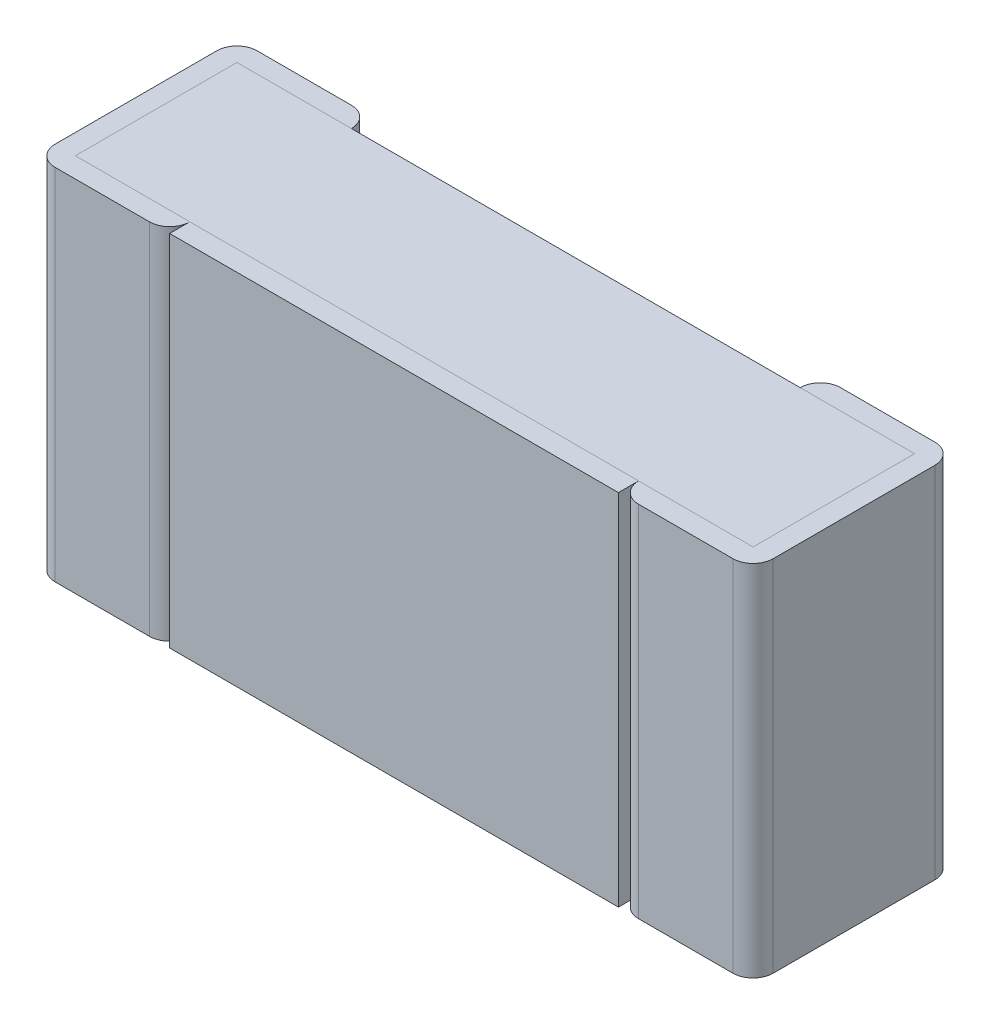
ISO-10303-21;
HEADER;
FILE_DESCRIPTION(('STEP AP214'),'2;1');
FILE_NAME('part.step','',(''),(''),'','','');
FILE_SCHEMA(('AUTOMOTIVE_DESIGN { 1 0 10303 214 1 1 1 1 }'));
ENDSEC;
DATA;
#1=APPLICATION_CONTEXT('core data for automotive mechanical design processes');
#2=APPLICATION_PROTOCOL_DEFINITION('international standard','automotive_design',2000,#1);
#3=PRODUCT_CONTEXT('',#1,'mechanical');
#4=PRODUCT('Part','Part','',(#3));
#5=PRODUCT_RELATED_PRODUCT_CATEGORY('part','',(#4));
#6=PRODUCT_DEFINITION_FORMATION('','',#4);
#7=PRODUCT_DEFINITION_CONTEXT('part definition',#1,'design');
#8=PRODUCT_DEFINITION('design','',#6,#7);
#9=PRODUCT_DEFINITION_SHAPE('','',#8);
#10=(LENGTH_UNIT() NAMED_UNIT(*) SI_UNIT(.MILLI.,.METRE.));
#11=(NAMED_UNIT(*) PLANE_ANGLE_UNIT() SI_UNIT($,.RADIAN.));
#12=(NAMED_UNIT(*) SI_UNIT($,.STERADIAN.) SOLID_ANGLE_UNIT());
#13=UNCERTAINTY_MEASURE_WITH_UNIT(LENGTH_MEASURE(1.E-05),#10,'distance_accuracy_value','');
#14=(GEOMETRIC_REPRESENTATION_CONTEXT(3) GLOBAL_UNCERTAINTY_ASSIGNED_CONTEXT((#13)) GLOBAL_UNIT_ASSIGNED_CONTEXT((#10,
#11,#12)) REPRESENTATION_CONTEXT('',''));
#15=CARTESIAN_POINT('',(0.,0.,0.));
#16=DIRECTION('',(0.,0.,1.));
#17=DIRECTION('',(1.,0.,0.));
#18=AXIS2_PLACEMENT_3D('',#15,#16,#17);
#19=CARTESIAN_POINT('',(-0.5,-0.4,0.45));
#20=DIRECTION('',(0.,0.,1.));
#21=DIRECTION('',(1.,0.,0.));
#22=AXIS2_PLACEMENT_3D('',#19,#20,#21);
#23=PLANE('',#22);
#24=DIRECTION('',(0.,1.,0.));
#25=VECTOR('',#24,1.);
#26=CARTESIAN_POINT('',(-0.5,-0.4,0.45));
#27=LINE('',#26,#25);
#28=CARTESIAN_POINT('',(-0.5,-0.4,0.45));
#29=VERTEX_POINT('',#28);
#30=CARTESIAN_POINT('',(-0.5,0.4,0.45));
#31=VERTEX_POINT('',#30);
#32=EDGE_CURVE('E393',#29,#31,#27,.T.);
#33=ORIENTED_EDGE('',*,*,#32,.F.);
#34=DIRECTION('',(1.,0.,0.));
#35=VECTOR('',#34,1.);
#36=CARTESIAN_POINT('',(-0.5,-0.4,0.45));
#37=LINE('',#36,#35);
#38=CARTESIAN_POINT('',(0.5,-0.4,0.45));
#39=VERTEX_POINT('',#38);
#40=EDGE_CURVE('E277',#29,#39,#37,.T.);
#41=ORIENTED_EDGE('',*,*,#40,.T.);
#42=DIRECTION('',(0.,1.,0.));
#43=VECTOR('',#42,1.);
#44=CARTESIAN_POINT('',(0.5,-0.4,0.45));
#45=LINE('',#44,#43);
#46=CARTESIAN_POINT('',(0.5,0.4,0.45));
#47=VERTEX_POINT('',#46);
#48=EDGE_CURVE('E11',#39,#47,#45,.T.);
#49=ORIENTED_EDGE('',*,*,#48,.T.);
#50=DIRECTION('',(1.,0.,0.));
#51=VECTOR('',#50,1.);
#52=CARTESIAN_POINT('',(-0.5,0.4,0.45));
#53=LINE('',#52,#51);
#54=EDGE_CURVE('E334',#31,#47,#53,.T.);
#55=ORIENTED_EDGE('',*,*,#54,.F.);
#56=EDGE_LOOP('',(#33,#41,#49,#55));
#57=FACE_BOUND('',#56,.T.);
#58=ADVANCED_FACE('F17',(#57),#23,.T.);
#59=CARTESIAN_POINT('',(0.5,-0.4,0.405));
#60=DIRECTION('',(1.,0.,0.));
#61=DIRECTION('',(0.,1.,0.));
#62=AXIS2_PLACEMENT_3D('',#59,#60,#61);
#63=PLANE('',#62);
#64=DIRECTION('',(0.,0.,1.));
#65=VECTOR('',#64,1.);
#66=CARTESIAN_POINT('',(0.5,-0.4,0.405));
#67=LINE('',#66,#65);
#68=CARTESIAN_POINT('',(0.5,-0.4,0.405));
#69=VERTEX_POINT('',#68);
#70=EDGE_CURVE('E281',#69,#39,#67,.T.);
#71=ORIENTED_EDGE('',*,*,#70,.F.);
#72=DIRECTION('',(0.,1.,0.));
#73=VECTOR('',#72,1.);
#74=CARTESIAN_POINT('',(0.5,-0.4,0.405));
#75=LINE('',#74,#73);
#76=CARTESIAN_POINT('',(0.5,0.4,0.405));
#77=VERTEX_POINT('',#76);
#78=EDGE_CURVE('E26',#69,#77,#75,.T.);
#79=ORIENTED_EDGE('',*,*,#78,.T.);
#80=DIRECTION('',(0.,0.,1.));
#81=VECTOR('',#80,1.);
#82=CARTESIAN_POINT('',(0.5,0.4,0.405));
#83=LINE('',#82,#81);
#84=EDGE_CURVE('E330',#77,#47,#83,.T.);
#85=ORIENTED_EDGE('',*,*,#84,.T.);
#86=ORIENTED_EDGE('',*,*,#48,.F.);
#87=EDGE_LOOP('',(#71,#79,#85,#86));
#88=FACE_BOUND('',#87,.T.);
#89=ADVANCED_FACE('F19',(#88),#63,.T.);
#90=CARTESIAN_POINT('',(0.545,-0.4,0.405));
#91=DIRECTION('',(0.,1.,0.));
#92=DIRECTION('',(-1.,0.,0.));
#93=AXIS2_PLACEMENT_3D('',#90,#91,#92);
#94=CYLINDRICAL_SURFACE('',#93,0.045);
#95=CARTESIAN_POINT('',(0.545,-0.4,0.405));
#96=DIRECTION('',(0.,1.,0.));
#97=DIRECTION('',(0.,0.,1.));
#98=AXIS2_PLACEMENT_3D('',#95,#96,#97);
#99=CIRCLE('',#98,0.045);
#100=CARTESIAN_POINT('',(0.545,-0.4,0.45));
#101=VERTEX_POINT('',#100);
#102=EDGE_CURVE('E223',#69,#101,#99,.T.);
#103=ORIENTED_EDGE('',*,*,#102,.T.);
#104=DIRECTION('',(0.,1.,0.));
#105=VECTOR('',#104,1.);
#106=CARTESIAN_POINT('',(0.545,-0.4,0.45));
#107=LINE('',#106,#105);
#108=CARTESIAN_POINT('',(0.545,0.4,0.45));
#109=VERTEX_POINT('',#108);
#110=EDGE_CURVE('E216',#101,#109,#107,.T.);
#111=ORIENTED_EDGE('',*,*,#110,.T.);
#112=CARTESIAN_POINT('',(0.545,0.4,0.405));
#113=DIRECTION('',(0.,1.,0.));
#114=DIRECTION('',(0.,0.,1.));
#115=AXIS2_PLACEMENT_3D('',#112,#113,#114);
#116=CIRCLE('',#115,0.045);
#117=EDGE_CURVE('E220',#77,#109,#116,.T.);
#118=ORIENTED_EDGE('',*,*,#117,.F.);
#119=ORIENTED_EDGE('',*,*,#78,.F.);
#120=EDGE_LOOP('',(#103,#111,#118,#119));
#121=FACE_BOUND('',#120,.T.);
#122=ADVANCED_FACE('F218',(#121),#94,.T.);
#123=CARTESIAN_POINT('',(0.5,-0.4,0.45));
#124=DIRECTION('',(0.,0.,1.));
#125=DIRECTION('',(1.,0.,0.));
#126=AXIS2_PLACEMENT_3D('',#123,#124,#125);
#127=PLANE('',#126);
#128=DIRECTION('',(1.,0.,0.));
#129=VECTOR('',#128,1.);
#130=CARTESIAN_POINT('',(0.5,0.4,0.45));
#131=LINE('',#130,#129);
#132=CARTESIAN_POINT('',(0.755,0.4,0.45));
#133=VERTEX_POINT('',#132);
#134=EDGE_CURVE('E231',#109,#133,#131,.T.);
#135=ORIENTED_EDGE('',*,*,#134,.F.);
#136=ORIENTED_EDGE('',*,*,#110,.F.);
#137=DIRECTION('',(1.,0.,0.));
#138=VECTOR('',#137,1.);
#139=CARTESIAN_POINT('',(0.5,-0.4,0.45));
#140=LINE('',#139,#138);
#141=CARTESIAN_POINT('',(0.755,-0.4,0.45));
#142=VERTEX_POINT('',#141);
#143=EDGE_CURVE('E371',#101,#142,#140,.T.);
#144=ORIENTED_EDGE('',*,*,#143,.T.);
#145=DIRECTION('',(0.,1.,0.));
#146=VECTOR('',#145,1.);
#147=CARTESIAN_POINT('',(0.755,-0.4,0.45));
#148=LINE('',#147,#146);
#149=EDGE_CURVE('E228',#142,#133,#148,.T.);
#150=ORIENTED_EDGE('',*,*,#149,.T.);
#151=EDGE_LOOP('',(#135,#136,#144,#150));
#152=FACE_BOUND('',#151,.T.);
#153=ADVANCED_FACE('F232',(#152),#127,.T.);
#154=CARTESIAN_POINT('',(0.755,-0.4,0.405));
#155=DIRECTION('',(0.,1.,0.));
#156=DIRECTION('',(1.,0.,0.));
#157=AXIS2_PLACEMENT_3D('',#154,#155,#156);
#158=CYLINDRICAL_SURFACE('',#157,0.045);
#159=DIRECTION('',(0.,1.,0.));
#160=VECTOR('',#159,1.);
#161=CARTESIAN_POINT('',(0.8,-0.4,0.405));
#162=LINE('',#161,#160);
#163=CARTESIAN_POINT('',(0.8,-0.4,0.405));
#164=VERTEX_POINT('',#163);
#165=CARTESIAN_POINT('',(0.8,0.4,0.405));
#166=VERTEX_POINT('',#165);
#167=EDGE_CURVE('E370',#164,#166,#162,.T.);
#168=ORIENTED_EDGE('',*,*,#167,.T.);
#169=CARTESIAN_POINT('',(0.755,0.4,0.405));
#170=DIRECTION('',(0.,-1.,0.));
#171=DIRECTION('',(0.,0.,1.));
#172=AXIS2_PLACEMENT_3D('',#169,#170,#171);
#173=CIRCLE('',#172,0.045);
#174=EDGE_CURVE('E237',#166,#133,#173,.T.);
#175=ORIENTED_EDGE('',*,*,#174,.T.);
#176=ORIENTED_EDGE('',*,*,#149,.F.);
#177=CARTESIAN_POINT('',(0.755,-0.4,0.405));
#178=DIRECTION('',(0.,-1.,0.));
#179=DIRECTION('',(0.,0.,1.));
#180=AXIS2_PLACEMENT_3D('',#177,#178,#179);
#181=CIRCLE('',#180,0.045);
#182=EDGE_CURVE('E374',#164,#142,#181,.T.);
#183=ORIENTED_EDGE('',*,*,#182,.F.);
#184=EDGE_LOOP('',(#168,#175,#176,#183));
#185=FACE_BOUND('',#184,.T.);
#186=ADVANCED_FACE('F480',(#185),#158,.T.);
#187=CARTESIAN_POINT('',(0.8,-0.4,0.));
#188=DIRECTION('',(1.,0.,0.));
#189=DIRECTION('',(0.,1.,0.));
#190=AXIS2_PLACEMENT_3D('',#187,#188,#189);
#191=PLANE('',#190);
#192=DIRECTION('',(0.,0.,1.));
#193=VECTOR('',#192,1.);
#194=CARTESIAN_POINT('',(0.8,-0.4,0.));
#195=LINE('',#194,#193);
#196=CARTESIAN_POINT('',(0.8,-0.4,0.045));
#197=VERTEX_POINT('',#196);
#198=EDGE_CURVE('E413',#197,#164,#195,.T.);
#199=ORIENTED_EDGE('',*,*,#198,.F.);
#200=DIRECTION('',(0.,1.,0.));
#201=VECTOR('',#200,1.);
#202=CARTESIAN_POINT('',(0.8,-0.4,0.045));
#203=LINE('',#202,#201);
#204=CARTESIAN_POINT('',(0.8,0.4,0.045));
#205=VERTEX_POINT('',#204);
#206=EDGE_CURVE('E46',#197,#205,#203,.T.);
#207=ORIENTED_EDGE('',*,*,#206,.T.);
#208=DIRECTION('',(0.,0.,1.));
#209=VECTOR('',#208,1.);
#210=CARTESIAN_POINT('',(0.8,0.4,0.));
#211=LINE('',#210,#209);
#212=EDGE_CURVE('E401',#205,#166,#211,.T.);
#213=ORIENTED_EDGE('',*,*,#212,.T.);
#214=ORIENTED_EDGE('',*,*,#167,.F.);
#215=EDGE_LOOP('',(#199,#207,#213,#214));
#216=FACE_BOUND('',#215,.T.);
#217=ADVANCED_FACE('F482',(#216),#191,.T.);
#218=CARTESIAN_POINT('',(0.755,-0.4,0.045));
#219=DIRECTION('',(0.,1.,0.));
#220=DIRECTION('',(1.,0.,0.));
#221=AXIS2_PLACEMENT_3D('',#218,#219,#220);
#222=CYLINDRICAL_SURFACE('',#221,0.045);
#223=CARTESIAN_POINT('',(0.755,-0.4,0.045));
#224=DIRECTION('',(0.,1.,0.));
#225=DIRECTION('',(0.,0.,1.));
#226=AXIS2_PLACEMENT_3D('',#223,#224,#225);
#227=CIRCLE('',#226,0.045);
#228=CARTESIAN_POINT('',(0.755,-0.4,0.));
#229=VERTEX_POINT('',#228);
#230=EDGE_CURVE('E409',#197,#229,#227,.T.);
#231=ORIENTED_EDGE('',*,*,#230,.T.);
#232=DIRECTION('',(0.,1.,0.));
#233=VECTOR('',#232,1.);
#234=CARTESIAN_POINT('',(0.755,-0.4,0.));
#235=LINE('',#234,#233);
#236=CARTESIAN_POINT('',(0.755,0.4,0.));
#237=VERTEX_POINT('',#236);
#238=EDGE_CURVE('E346',#229,#237,#235,.T.);
#239=ORIENTED_EDGE('',*,*,#238,.T.);
#240=CARTESIAN_POINT('',(0.755,0.4,0.045));
#241=DIRECTION('',(0.,1.,0.));
#242=DIRECTION('',(0.,0.,1.));
#243=AXIS2_PLACEMENT_3D('',#240,#241,#242);
#244=CIRCLE('',#243,0.045);
#245=EDGE_CURVE('E392',#205,#237,#244,.T.);
#246=ORIENTED_EDGE('',*,*,#245,.F.);
#247=ORIENTED_EDGE('',*,*,#206,.F.);
#248=EDGE_LOOP('',(#231,#239,#246,#247));
#249=FACE_BOUND('',#248,.T.);
#250=ADVANCED_FACE('F485',(#249),#222,.T.);
#251=CARTESIAN_POINT('',(0.5,-0.4,0.));
#252=DIRECTION('',(0.,0.,1.));
#253=DIRECTION('',(1.,0.,0.));
#254=AXIS2_PLACEMENT_3D('',#251,#252,#253);
#255=PLANE('',#254);
#256=ORIENTED_EDGE('',*,*,#238,.F.);
#257=DIRECTION('',(1.,0.,0.));
#258=VECTOR('',#257,1.);
#259=CARTESIAN_POINT('',(0.5,-0.4,0.));
#260=LINE('',#259,#258);
#261=CARTESIAN_POINT('',(0.545,-0.4,0.));
#262=VERTEX_POINT('',#261);
#263=EDGE_CURVE('E433',#262,#229,#260,.T.);
#264=ORIENTED_EDGE('',*,*,#263,.F.);
#265=DIRECTION('',(0.,1.,0.));
#266=VECTOR('',#265,1.);
#267=CARTESIAN_POINT('',(0.545,-0.4,0.));
#268=LINE('',#267,#266);
#269=CARTESIAN_POINT('',(0.545,0.4,0.));
#270=VERTEX_POINT('',#269);
#271=EDGE_CURVE('E333',#262,#270,#268,.T.);
#272=ORIENTED_EDGE('',*,*,#271,.T.);
#273=DIRECTION('',(1.,0.,0.));
#274=VECTOR('',#273,1.);
#275=CARTESIAN_POINT('',(0.5,0.4,0.));
#276=LINE('',#275,#274);
#277=EDGE_CURVE('E252',#270,#237,#276,.T.);
#278=ORIENTED_EDGE('',*,*,#277,.T.);
#279=EDGE_LOOP('',(#256,#264,#272,#278));
#280=FACE_BOUND('',#279,.T.);
#281=ADVANCED_FACE('F487',(#280),#255,.F.);
#282=CARTESIAN_POINT('',(0.545,-0.4,0.045));
#283=DIRECTION('',(0.,1.,0.));
#284=DIRECTION('',(-1.,0.,0.));
#285=AXIS2_PLACEMENT_3D('',#282,#283,#284);
#286=CYLINDRICAL_SURFACE('',#285,0.045);
#287=DIRECTION('',(0.,1.,0.));
#288=VECTOR('',#287,1.);
#289=CARTESIAN_POINT('',(0.5,-0.4,0.045));
#290=LINE('',#289,#288);
#291=CARTESIAN_POINT('',(0.5,-0.4,0.045));
#292=VERTEX_POINT('',#291);
#293=CARTESIAN_POINT('',(0.5,0.4,0.045));
#294=VERTEX_POINT('',#293);
#295=EDGE_CURVE('E342',#292,#294,#290,.T.);
#296=ORIENTED_EDGE('',*,*,#295,.T.);
#297=CARTESIAN_POINT('',(0.545,0.4,0.045));
#298=DIRECTION('',(0.,-1.,0.));
#299=DIRECTION('',(0.,0.,1.));
#300=AXIS2_PLACEMENT_3D('',#297,#298,#299);
#301=CIRCLE('',#300,0.045);
#302=EDGE_CURVE('E245',#294,#270,#301,.T.);
#303=ORIENTED_EDGE('',*,*,#302,.T.);
#304=ORIENTED_EDGE('',*,*,#271,.F.);
#305=CARTESIAN_POINT('',(0.545,-0.4,0.045));
#306=DIRECTION('',(0.,-1.,0.));
#307=DIRECTION('',(0.,0.,1.));
#308=AXIS2_PLACEMENT_3D('',#305,#306,#307);
#309=CIRCLE('',#308,0.045);
#310=EDGE_CURVE('E429',#292,#262,#309,.T.);
#311=ORIENTED_EDGE('',*,*,#310,.F.);
#312=EDGE_LOOP('',(#296,#303,#304,#311));
#313=FACE_BOUND('',#312,.T.);
#314=ADVANCED_FACE('F492',(#313),#286,.T.);
#315=CARTESIAN_POINT('',(-0.5,0.4,0.405));
#316=DIRECTION('',(0.,1.,0.));
#317=DIRECTION('',(1.,0.,0.));
#318=AXIS2_PLACEMENT_3D('',#315,#316,#317);
#319=PLANE('',#318);
#320=DIRECTION('',(1.,0.,0.));
#321=VECTOR('',#320,1.);
#322=CARTESIAN_POINT('',(-0.5,0.4,0.405));
#323=LINE('',#322,#321);
#324=CARTESIAN_POINT('',(-0.5,0.4,0.405));
#325=VERTEX_POINT('',#324);
#326=EDGE_CURVE('E290',#325,#77,#323,.T.);
#327=ORIENTED_EDGE('',*,*,#326,.F.);
#328=DIRECTION('',(0.,0.,1.));
#329=VECTOR('',#328,1.);
#330=CARTESIAN_POINT('',(-0.5,0.4,0.405));
#331=LINE('',#330,#329);
#332=EDGE_CURVE('E397',#325,#31,#331,.T.);
#333=ORIENTED_EDGE('',*,*,#332,.T.);
#334=ORIENTED_EDGE('',*,*,#54,.T.);
#335=ORIENTED_EDGE('',*,*,#84,.F.);
#336=EDGE_LOOP('',(#327,#333,#334,#335));
#337=FACE_BOUND('',#336,.T.);
#338=ADVANCED_FACE('F461',(#337),#319,.T.);
#339=CARTESIAN_POINT('',(0.5,0.4,0.));
#340=DIRECTION('',(0.,1.,0.));
#341=DIRECTION('',(1.,0.,0.));
#342=AXIS2_PLACEMENT_3D('',#339,#340,#341);
#343=PLANE('',#342);
#344=ORIENTED_EDGE('',*,*,#277,.F.);
#345=ORIENTED_EDGE('',*,*,#302,.F.);
#346=DIRECTION('',(1.,0.,0.));
#347=VECTOR('',#346,1.);
#348=CARTESIAN_POINT('',(-0.755,0.4,0.045));
#349=LINE('',#348,#347);
#350=CARTESIAN_POINT('',(0.755,0.4,0.045));
#351=VERTEX_POINT('',#350);
#352=EDGE_CURVE('E321',#294,#351,#349,.T.);
#353=ORIENTED_EDGE('',*,*,#352,.T.);
#354=DIRECTION('',(0.,0.,1.));
#355=VECTOR('',#354,1.);
#356=CARTESIAN_POINT('',(0.755,0.4,0.045));
#357=LINE('',#356,#355);
#358=CARTESIAN_POINT('',(0.755,0.4,0.405));
#359=VERTEX_POINT('',#358);
#360=EDGE_CURVE('E325',#351,#359,#357,.T.);
#361=ORIENTED_EDGE('',*,*,#360,.T.);
#362=DIRECTION('',(1.,0.,0.));
#363=VECTOR('',#362,1.);
#364=CARTESIAN_POINT('',(-0.755,0.4,0.405));
#365=LINE('',#364,#363);
#366=EDGE_CURVE('E242',#77,#359,#365,.T.);
#367=ORIENTED_EDGE('',*,*,#366,.F.);
#368=ORIENTED_EDGE('',*,*,#117,.T.);
#369=ORIENTED_EDGE('',*,*,#134,.T.);
#370=ORIENTED_EDGE('',*,*,#174,.F.);
#371=ORIENTED_EDGE('',*,*,#212,.F.);
#372=ORIENTED_EDGE('',*,*,#245,.T.);
#373=EDGE_LOOP('',(#344,#345,#353,#361,#367,#368,#369,#370,#371,#372));
#374=FACE_BOUND('',#373,.T.);
#375=ADVANCED_FACE('F240',(#374),#343,.T.);
#376=CARTESIAN_POINT('',(-0.5,-0.4,0.405));
#377=DIRECTION('',(1.,0.,0.));
#378=DIRECTION('',(0.,1.,0.));
#379=AXIS2_PLACEMENT_3D('',#376,#377,#378);
#380=PLANE('',#379);
#381=ORIENTED_EDGE('',*,*,#32,.T.);
#382=ORIENTED_EDGE('',*,*,#332,.F.);
#383=DIRECTION('',(0.,1.,0.));
#384=VECTOR('',#383,1.);
#385=CARTESIAN_POINT('',(-0.5,-0.4,0.405));
#386=LINE('',#385,#384);
#387=CARTESIAN_POINT('',(-0.5,-0.4,0.405));
#388=VERTEX_POINT('',#387);
#389=EDGE_CURVE('E293',#388,#325,#386,.T.);
#390=ORIENTED_EDGE('',*,*,#389,.F.);
#391=DIRECTION('',(0.,0.,1.));
#392=VECTOR('',#391,1.);
#393=CARTESIAN_POINT('',(-0.5,-0.4,0.405));
#394=LINE('',#393,#392);
#395=EDGE_CURVE('E280',#388,#29,#394,.T.);
#396=ORIENTED_EDGE('',*,*,#395,.T.);
#397=EDGE_LOOP('',(#381,#382,#390,#396));
#398=FACE_BOUND('',#397,.T.);
#399=ADVANCED_FACE('F465',(#398),#380,.F.);
#400=CARTESIAN_POINT('',(-0.5,-0.4,0.405));
#401=DIRECTION('',(0.,1.,0.));
#402=DIRECTION('',(1.,0.,0.));
#403=AXIS2_PLACEMENT_3D('',#400,#401,#402);
#404=PLANE('',#403);
#405=ORIENTED_EDGE('',*,*,#70,.T.);
#406=ORIENTED_EDGE('',*,*,#40,.F.);
#407=ORIENTED_EDGE('',*,*,#395,.F.);
#408=DIRECTION('',(1.,0.,0.));
#409=VECTOR('',#408,1.);
#410=CARTESIAN_POINT('',(-0.5,-0.4,0.405));
#411=LINE('',#410,#409);
#412=EDGE_CURVE('E382',#388,#69,#411,.T.);
#413=ORIENTED_EDGE('',*,*,#412,.T.);
#414=EDGE_LOOP('',(#405,#406,#407,#413));
#415=FACE_BOUND('',#414,.T.);
#416=ADVANCED_FACE('F468',(#415),#404,.F.);
#417=CARTESIAN_POINT('',(0.5,-0.4,0.));
#418=DIRECTION('',(0.,1.,0.));
#419=DIRECTION('',(1.,0.,0.));
#420=AXIS2_PLACEMENT_3D('',#417,#418,#419);
#421=PLANE('',#420);
#422=ORIENTED_EDGE('',*,*,#230,.F.);
#423=ORIENTED_EDGE('',*,*,#198,.T.);
#424=ORIENTED_EDGE('',*,*,#182,.T.);
#425=ORIENTED_EDGE('',*,*,#143,.F.);
#426=ORIENTED_EDGE('',*,*,#102,.F.);
#427=DIRECTION('',(1.,0.,0.));
#428=VECTOR('',#427,1.);
#429=CARTESIAN_POINT('',(-0.755,-0.4,0.405));
#430=LINE('',#429,#428);
#431=CARTESIAN_POINT('',(0.755,-0.4,0.405));
#432=VERTEX_POINT('',#431);
#433=EDGE_CURVE('E379',#69,#432,#430,.T.);
#434=ORIENTED_EDGE('',*,*,#433,.T.);
#435=DIRECTION('',(0.,0.,1.));
#436=VECTOR('',#435,1.);
#437=CARTESIAN_POINT('',(0.755,-0.4,0.045));
#438=LINE('',#437,#436);
#439=CARTESIAN_POINT('',(0.755,-0.4,0.045));
#440=VERTEX_POINT('',#439);
#441=EDGE_CURVE('E378',#440,#432,#438,.T.);
#442=ORIENTED_EDGE('',*,*,#441,.F.);
#443=DIRECTION('',(1.,0.,0.));
#444=VECTOR('',#443,1.);
#445=CARTESIAN_POINT('',(-0.755,-0.4,0.045));
#446=LINE('',#445,#444);
#447=EDGE_CURVE('E367',#292,#440,#446,.T.);
#448=ORIENTED_EDGE('',*,*,#447,.F.);
#449=ORIENTED_EDGE('',*,*,#310,.T.);
#450=ORIENTED_EDGE('',*,*,#263,.T.);
#451=EDGE_LOOP('',(#422,#423,#424,#425,#426,#434,#442,#448,#449,#450));
#452=FACE_BOUND('',#451,.T.);
#453=ADVANCED_FACE('F476',(#452),#421,.F.);
#454=CARTESIAN_POINT('',(-0.755,-0.4,0.045));
#455=DIRECTION('',(0.,0.,1.));
#456=DIRECTION('',(1.,0.,0.));
#457=AXIS2_PLACEMENT_3D('',#454,#455,#456);
#458=PLANE('',#457);
#459=DIRECTION('',(1.,0.,0.));
#460=VECTOR('',#459,1.);
#461=CARTESIAN_POINT('',(-0.755,0.4,0.045));
#462=LINE('',#461,#460);
#463=CARTESIAN_POINT('',(-0.5,0.4,0.045));
#464=VERTEX_POINT('',#463);
#465=EDGE_CURVE('E324',#464,#294,#462,.T.);
#466=ORIENTED_EDGE('',*,*,#465,.T.);
#467=ORIENTED_EDGE('',*,*,#295,.F.);
#468=DIRECTION('',(1.,0.,0.));
#469=VECTOR('',#468,1.);
#470=CARTESIAN_POINT('',(-0.755,-0.4,0.045));
#471=LINE('',#470,#469);
#472=CARTESIAN_POINT('',(-0.5,-0.4,0.045));
#473=VERTEX_POINT('',#472);
#474=EDGE_CURVE('E363',#473,#292,#471,.T.);
#475=ORIENTED_EDGE('',*,*,#474,.F.);
#476=DIRECTION('',(0.,1.,0.));
#477=VECTOR('',#476,1.);
#478=CARTESIAN_POINT('',(-0.5,-0.4,0.045));
#479=LINE('',#478,#477);
#480=EDGE_CURVE('E359',#473,#464,#479,.T.);
#481=ORIENTED_EDGE('',*,*,#480,.T.);
#482=EDGE_LOOP('',(#466,#467,#475,#481));
#483=FACE_BOUND('',#482,.T.);
#484=ADVANCED_FACE('F494',(#483),#458,.F.);
#485=CARTESIAN_POINT('',(-0.755,0.4,0.045));
#486=DIRECTION('',(0.,1.,0.));
#487=DIRECTION('',(1.,0.,0.));
#488=AXIS2_PLACEMENT_3D('',#485,#486,#487);
#489=PLANE('',#488);
#490=DIRECTION('',(1.,0.,0.));
#491=VECTOR('',#490,1.);
#492=CARTESIAN_POINT('',(-0.755,0.4,0.045));
#493=LINE('',#492,#491);
#494=CARTESIAN_POINT('',(-0.755,0.4,0.045));
#495=VERTEX_POINT('',#494);
#496=EDGE_CURVE('E345',#495,#464,#493,.T.);
#497=ORIENTED_EDGE('',*,*,#496,.F.);
#498=DIRECTION('',(0.,0.,1.));
#499=VECTOR('',#498,1.);
#500=CARTESIAN_POINT('',(-0.755,0.4,0.045));
#501=LINE('',#500,#499);
#502=CARTESIAN_POINT('',(-0.755,0.4,0.405));
#503=VERTEX_POINT('',#502);
#504=EDGE_CURVE('E338',#495,#503,#501,.T.);
#505=ORIENTED_EDGE('',*,*,#504,.T.);
#506=DIRECTION('',(1.,0.,0.));
#507=VECTOR('',#506,1.);
#508=CARTESIAN_POINT('',(-0.755,0.4,0.405));
#509=LINE('',#508,#507);
#510=EDGE_CURVE('E329',#503,#325,#509,.T.);
#511=ORIENTED_EDGE('',*,*,#510,.T.);
#512=ORIENTED_EDGE('',*,*,#326,.T.);
#513=ORIENTED_EDGE('',*,*,#366,.T.);
#514=ORIENTED_EDGE('',*,*,#360,.F.);
#515=ORIENTED_EDGE('',*,*,#352,.F.);
#516=ORIENTED_EDGE('',*,*,#465,.F.);
#517=EDGE_LOOP('',(#497,#505,#511,#512,#513,#514,#515,#516));
#518=FACE_BOUND('',#517,.T.);
#519=ADVANCED_FACE('F498',(#518),#489,.T.);
#520=CARTESIAN_POINT('',(-0.545,-0.4,0.405));
#521=DIRECTION('',(0.,1.,0.));
#522=DIRECTION('',(1.,0.,0.));
#523=AXIS2_PLACEMENT_3D('',#520,#521,#522);
#524=CYLINDRICAL_SURFACE('',#523,0.045);
#525=ORIENTED_EDGE('',*,*,#389,.T.);
#526=CARTESIAN_POINT('',(-0.545,0.4,0.405));
#527=DIRECTION('',(0.,-1.,0.));
#528=DIRECTION('',(0.,0.,1.));
#529=AXIS2_PLACEMENT_3D('',#526,#527,#528);
#530=CIRCLE('',#529,0.045);
#531=CARTESIAN_POINT('',(-0.545,0.4,0.45));
#532=VERTEX_POINT('',#531);
#533=EDGE_CURVE('E261',#325,#532,#530,.T.);
#534=ORIENTED_EDGE('',*,*,#533,.T.);
#535=DIRECTION('',(0.,1.,0.));
#536=VECTOR('',#535,1.);
#537=CARTESIAN_POINT('',(-0.545,-0.4,0.45));
#538=LINE('',#537,#536);
#539=CARTESIAN_POINT('',(-0.545,-0.4,0.45));
#540=VERTEX_POINT('',#539);
#541=EDGE_CURVE('E386',#540,#532,#538,.T.);
#542=ORIENTED_EDGE('',*,*,#541,.F.);
#543=CARTESIAN_POINT('',(-0.545,-0.4,0.405));
#544=DIRECTION('',(0.,-1.,0.));
#545=DIRECTION('',(0.,0.,1.));
#546=AXIS2_PLACEMENT_3D('',#543,#544,#545);
#547=CIRCLE('',#546,0.045);
#548=EDGE_CURVE('E267',#388,#540,#547,.T.);
#549=ORIENTED_EDGE('',*,*,#548,.F.);
#550=EDGE_LOOP('',(#525,#534,#542,#549));
#551=FACE_BOUND('',#550,.T.);
#552=ADVANCED_FACE('F505',(#551),#524,.T.);
#553=CARTESIAN_POINT('',(-0.8,-0.4,0.45));
#554=DIRECTION('',(0.,0.,1.));
#555=DIRECTION('',(1.,0.,0.));
#556=AXIS2_PLACEMENT_3D('',#553,#554,#555);
#557=PLANE('',#556);
#558=DIRECTION('',(1.,0.,0.));
#559=VECTOR('',#558,1.);
#560=CARTESIAN_POINT('',(-0.8,0.4,0.45));
#561=LINE('',#560,#559);
#562=CARTESIAN_POINT('',(-0.755,0.4,0.45));
#563=VERTEX_POINT('',#562);
#564=EDGE_CURVE('E258',#563,#532,#561,.T.);
#565=ORIENTED_EDGE('',*,*,#564,.F.);
#566=DIRECTION('',(0.,1.,0.));
#567=VECTOR('',#566,1.);
#568=CARTESIAN_POINT('',(-0.755,-0.4,0.45));
#569=LINE('',#568,#567);
#570=CARTESIAN_POINT('',(-0.755,-0.4,0.45));
#571=VERTEX_POINT('',#570);
#572=EDGE_CURVE('E309',#571,#563,#569,.T.);
#573=ORIENTED_EDGE('',*,*,#572,.F.);
#574=DIRECTION('',(1.,0.,0.));
#575=VECTOR('',#574,1.);
#576=CARTESIAN_POINT('',(-0.8,-0.4,0.45));
#577=LINE('',#576,#575);
#578=EDGE_CURVE('E285',#571,#540,#577,.T.);
#579=ORIENTED_EDGE('',*,*,#578,.T.);
#580=ORIENTED_EDGE('',*,*,#541,.T.);
#581=EDGE_LOOP('',(#565,#573,#579,#580));
#582=FACE_BOUND('',#581,.T.);
#583=ADVANCED_FACE('F549',(#582),#557,.T.);
#584=CARTESIAN_POINT('',(-0.755,-0.4,0.045));
#585=DIRECTION('',(0.,1.,0.));
#586=DIRECTION('',(1.,0.,0.));
#587=AXIS2_PLACEMENT_3D('',#584,#585,#586);
#588=PLANE('',#587);
#589=ORIENTED_EDGE('',*,*,#474,.T.);
#590=ORIENTED_EDGE('',*,*,#447,.T.);
#591=ORIENTED_EDGE('',*,*,#441,.T.);
#592=ORIENTED_EDGE('',*,*,#433,.F.);
#593=ORIENTED_EDGE('',*,*,#412,.F.);
#594=DIRECTION('',(1.,0.,0.));
#595=VECTOR('',#594,1.);
#596=CARTESIAN_POINT('',(-0.755,-0.4,0.405));
#597=LINE('',#596,#595);
#598=CARTESIAN_POINT('',(-0.755,-0.4,0.405));
#599=VERTEX_POINT('',#598);
#600=EDGE_CURVE('E263',#599,#388,#597,.T.);
#601=ORIENTED_EDGE('',*,*,#600,.F.);
#602=DIRECTION('',(0.,0.,1.));
#603=VECTOR('',#602,1.);
#604=CARTESIAN_POINT('',(-0.755,-0.4,0.045));
#605=LINE('',#604,#603);
#606=CARTESIAN_POINT('',(-0.755,-0.4,0.045));
#607=VERTEX_POINT('',#606);
#608=EDGE_CURVE('E268',#607,#599,#605,.T.);
#609=ORIENTED_EDGE('',*,*,#608,.F.);
#610=DIRECTION('',(1.,0.,0.));
#611=VECTOR('',#610,1.);
#612=CARTESIAN_POINT('',(-0.755,-0.4,0.045));
#613=LINE('',#612,#611);
#614=EDGE_CURVE('E273',#607,#473,#613,.T.);
#615=ORIENTED_EDGE('',*,*,#614,.T.);
#616=EDGE_LOOP('',(#589,#590,#591,#592,#593,#601,#609,#615));
#617=FACE_BOUND('',#616,.T.);
#618=ADVANCED_FACE('F473',(#617),#588,.F.);
#619=CARTESIAN_POINT('',(-0.545,-0.4,0.045));
#620=DIRECTION('',(0.,1.,0.));
#621=DIRECTION('',(1.,0.,0.));
#622=AXIS2_PLACEMENT_3D('',#619,#620,#621);
#623=CYLINDRICAL_SURFACE('',#622,0.045);
#624=CARTESIAN_POINT('',(-0.545,-0.4,0.045));
#625=DIRECTION('',(0.,1.,0.));
#626=DIRECTION('',(0.,0.,1.));
#627=AXIS2_PLACEMENT_3D('',#624,#625,#626);
#628=CIRCLE('',#627,0.045);
#629=CARTESIAN_POINT('',(-0.545,-0.4,0.));
#630=VERTEX_POINT('',#629);
#631=EDGE_CURVE('E269',#473,#630,#628,.T.);
#632=ORIENTED_EDGE('',*,*,#631,.T.);
#633=DIRECTION('',(0.,1.,0.));
#634=VECTOR('',#633,1.);
#635=CARTESIAN_POINT('',(-0.545,-0.4,0.));
#636=LINE('',#635,#634);
#637=CARTESIAN_POINT('',(-0.545,0.4,0.));
#638=VERTEX_POINT('',#637);
#639=EDGE_CURVE('E356',#630,#638,#636,.T.);
#640=ORIENTED_EDGE('',*,*,#639,.T.);
#641=CARTESIAN_POINT('',(-0.545,0.4,0.045));
#642=DIRECTION('',(0.,1.,0.));
#643=DIRECTION('',(0.,0.,1.));
#644=AXIS2_PLACEMENT_3D('',#641,#642,#643);
#645=CIRCLE('',#644,0.045);
#646=EDGE_CURVE('E352',#464,#638,#645,.T.);
#647=ORIENTED_EDGE('',*,*,#646,.F.);
#648=ORIENTED_EDGE('',*,*,#480,.F.);
#649=EDGE_LOOP('',(#632,#640,#647,#648));
#650=FACE_BOUND('',#649,.T.);
#651=ADVANCED_FACE('F516',(#650),#623,.T.);
#652=CARTESIAN_POINT('',(-0.8,-0.4,0.));
#653=DIRECTION('',(0.,0.,1.));
#654=DIRECTION('',(1.,0.,0.));
#655=AXIS2_PLACEMENT_3D('',#652,#653,#654);
#656=PLANE('',#655);
#657=ORIENTED_EDGE('',*,*,#639,.F.);
#658=DIRECTION('',(1.,0.,0.));
#659=VECTOR('',#658,1.);
#660=CARTESIAN_POINT('',(-0.8,-0.4,0.));
#661=LINE('',#660,#659);
#662=CARTESIAN_POINT('',(-0.755,-0.4,0.));
#663=VERTEX_POINT('',#662);
#664=EDGE_CURVE('E298',#663,#630,#661,.T.);
#665=ORIENTED_EDGE('',*,*,#664,.F.);
#666=DIRECTION('',(0.,1.,0.));
#667=VECTOR('',#666,1.);
#668=CARTESIAN_POINT('',(-0.755,-0.4,0.));
#669=LINE('',#668,#667);
#670=CARTESIAN_POINT('',(-0.755,0.4,0.));
#671=VERTEX_POINT('',#670);
#672=EDGE_CURVE('E306',#663,#671,#669,.T.);
#673=ORIENTED_EDGE('',*,*,#672,.T.);
#674=DIRECTION('',(1.,0.,0.));
#675=VECTOR('',#674,1.);
#676=CARTESIAN_POINT('',(-0.8,0.4,0.));
#677=LINE('',#676,#675);
#678=EDGE_CURVE('E262',#671,#638,#677,.T.);
#679=ORIENTED_EDGE('',*,*,#678,.T.);
#680=EDGE_LOOP('',(#657,#665,#673,#679));
#681=FACE_BOUND('',#680,.T.);
#682=ADVANCED_FACE('F518',(#681),#656,.F.);
#683=CARTESIAN_POINT('',(-0.8,0.4,0.));
#684=DIRECTION('',(0.,1.,0.));
#685=DIRECTION('',(1.,0.,0.));
#686=AXIS2_PLACEMENT_3D('',#683,#684,#685);
#687=PLANE('',#686);
#688=ORIENTED_EDGE('',*,*,#678,.F.);
#689=CARTESIAN_POINT('',(-0.755,0.4,0.045));
#690=DIRECTION('',(0.,-1.,0.));
#691=DIRECTION('',(0.,0.,1.));
#692=AXIS2_PLACEMENT_3D('',#689,#690,#691);
#693=CIRCLE('',#692,0.045);
#694=CARTESIAN_POINT('',(-0.8,0.4,0.045));
#695=VERTEX_POINT('',#694);
#696=EDGE_CURVE('E302',#695,#671,#693,.T.);
#697=ORIENTED_EDGE('',*,*,#696,.F.);
#698=DIRECTION('',(0.,0.,1.));
#699=VECTOR('',#698,1.);
#700=CARTESIAN_POINT('',(-0.8,0.4,0.));
#701=LINE('',#700,#699);
#702=CARTESIAN_POINT('',(-0.8,0.4,0.405));
#703=VERTEX_POINT('',#702);
#704=EDGE_CURVE('E526',#695,#703,#701,.T.);
#705=ORIENTED_EDGE('',*,*,#704,.T.);
#706=CARTESIAN_POINT('',(-0.755,0.4,0.405));
#707=DIRECTION('',(0.,1.,0.));
#708=DIRECTION('',(0.,0.,1.));
#709=AXIS2_PLACEMENT_3D('',#706,#707,#708);
#710=CIRCLE('',#709,0.045);
#711=EDGE_CURVE('E313',#703,#563,#710,.T.);
#712=ORIENTED_EDGE('',*,*,#711,.T.);
#713=ORIENTED_EDGE('',*,*,#564,.T.);
#714=ORIENTED_EDGE('',*,*,#533,.F.);
#715=ORIENTED_EDGE('',*,*,#510,.F.);
#716=ORIENTED_EDGE('',*,*,#504,.F.);
#717=ORIENTED_EDGE('',*,*,#496,.T.);
#718=ORIENTED_EDGE('',*,*,#646,.T.);
#719=EDGE_LOOP('',(#688,#697,#705,#712,#713,#714,#715,#716,#717,#718));
#720=FACE_BOUND('',#719,.T.);
#721=ADVANCED_FACE('F503',(#720),#687,.T.);
#722=CARTESIAN_POINT('',(-0.755,-0.4,0.405));
#723=DIRECTION('',(0.,1.,0.));
#724=DIRECTION('',(-1.,0.,0.));
#725=AXIS2_PLACEMENT_3D('',#722,#723,#724);
#726=CYLINDRICAL_SURFACE('',#725,0.045);
#727=CARTESIAN_POINT('',(-0.755,-0.4,0.405));
#728=DIRECTION('',(0.,1.,0.));
#729=DIRECTION('',(0.,0.,1.));
#730=AXIS2_PLACEMENT_3D('',#727,#728,#729);
#731=CIRCLE('',#730,0.045);
#732=CARTESIAN_POINT('',(-0.8,-0.4,0.405));
#733=VERTEX_POINT('',#732);
#734=EDGE_CURVE('E289',#733,#571,#731,.T.);
#735=ORIENTED_EDGE('',*,*,#734,.T.);
#736=ORIENTED_EDGE('',*,*,#572,.T.);
#737=ORIENTED_EDGE('',*,*,#711,.F.);
#738=DIRECTION('',(0.,1.,0.));
#739=VECTOR('',#738,1.);
#740=CARTESIAN_POINT('',(-0.8,-0.4,0.405));
#741=LINE('',#740,#739);
#742=EDGE_CURVE('E530',#733,#703,#741,.T.);
#743=ORIENTED_EDGE('',*,*,#742,.F.);
#744=EDGE_LOOP('',(#735,#736,#737,#743));
#745=FACE_BOUND('',#744,.T.);
#746=ADVANCED_FACE('F547',(#745),#726,.T.);
#747=CARTESIAN_POINT('',(-0.755,-0.4,0.045));
#748=DIRECTION('',(0.,1.,0.));
#749=DIRECTION('',(-1.,0.,0.));
#750=AXIS2_PLACEMENT_3D('',#747,#748,#749);
#751=CYLINDRICAL_SURFACE('',#750,0.045);
#752=DIRECTION('',(0.,1.,0.));
#753=VECTOR('',#752,1.);
#754=CARTESIAN_POINT('',(-0.8,-0.4,0.045));
#755=LINE('',#754,#753);
#756=CARTESIAN_POINT('',(-0.8,-0.4,0.045));
#757=VERTEX_POINT('',#756);
#758=EDGE_CURVE('E523',#757,#695,#755,.T.);
#759=ORIENTED_EDGE('',*,*,#758,.T.);
#760=ORIENTED_EDGE('',*,*,#696,.T.);
#761=ORIENTED_EDGE('',*,*,#672,.F.);
#762=CARTESIAN_POINT('',(-0.755,-0.4,0.045));
#763=DIRECTION('',(0.,-1.,0.));
#764=DIRECTION('',(0.,0.,1.));
#765=AXIS2_PLACEMENT_3D('',#762,#763,#764);
#766=CIRCLE('',#765,0.045);
#767=EDGE_CURVE('E294',#757,#663,#766,.T.);
#768=ORIENTED_EDGE('',*,*,#767,.F.);
#769=EDGE_LOOP('',(#759,#760,#761,#768));
#770=FACE_BOUND('',#769,.T.);
#771=ADVANCED_FACE('F521',(#770),#751,.T.);
#772=CARTESIAN_POINT('',(-0.8,-0.4,0.));
#773=DIRECTION('',(0.,1.,0.));
#774=DIRECTION('',(1.,0.,0.));
#775=AXIS2_PLACEMENT_3D('',#772,#773,#774);
#776=PLANE('',#775);
#777=ORIENTED_EDGE('',*,*,#631,.F.);
#778=ORIENTED_EDGE('',*,*,#614,.F.);
#779=ORIENTED_EDGE('',*,*,#608,.T.);
#780=ORIENTED_EDGE('',*,*,#600,.T.);
#781=ORIENTED_EDGE('',*,*,#548,.T.);
#782=ORIENTED_EDGE('',*,*,#578,.F.);
#783=ORIENTED_EDGE('',*,*,#734,.F.);
#784=DIRECTION('',(0.,0.,1.));
#785=VECTOR('',#784,1.);
#786=CARTESIAN_POINT('',(-0.8,-0.4,0.));
#787=LINE('',#786,#785);
#788=EDGE_CURVE('E256',#757,#733,#787,.T.);
#789=ORIENTED_EDGE('',*,*,#788,.F.);
#790=ORIENTED_EDGE('',*,*,#767,.T.);
#791=ORIENTED_EDGE('',*,*,#664,.T.);
#792=EDGE_LOOP('',(#777,#778,#779,#780,#781,#782,#783,#789,#790,#791));
#793=FACE_BOUND('',#792,.T.);
#794=ADVANCED_FACE('F512',(#793),#776,.F.);
#795=CARTESIAN_POINT('',(-0.8,-0.4,0.));
#796=DIRECTION('',(1.,0.,0.));
#797=DIRECTION('',(0.,1.,0.));
#798=AXIS2_PLACEMENT_3D('',#795,#796,#797);
#799=PLANE('',#798);
#800=ORIENTED_EDGE('',*,*,#742,.T.);
#801=ORIENTED_EDGE('',*,*,#704,.F.);
#802=ORIENTED_EDGE('',*,*,#758,.F.);
#803=ORIENTED_EDGE('',*,*,#788,.T.);
#804=EDGE_LOOP('',(#800,#801,#802,#803));
#805=FACE_BOUND('',#804,.T.);
#806=ADVANCED_FACE('F534',(#805),#799,.F.);
#807=CLOSED_SHELL('',(#58,#89,#122,#153,#186,#217,#250,#281,#314,#338,#375,#399,#416,#453,#484,
#519,#552,#583,#618,#651,#682,#721,#746,#771,#794,#806));
#808=MANIFOLD_SOLID_BREP('B1',#807);
#809=ADVANCED_BREP_SHAPE_REPRESENTATION('',(#18,#808),#14);
#810=SHAPE_DEFINITION_REPRESENTATION(#9,#809);
ENDSEC;
END-ISO-10303-21;
